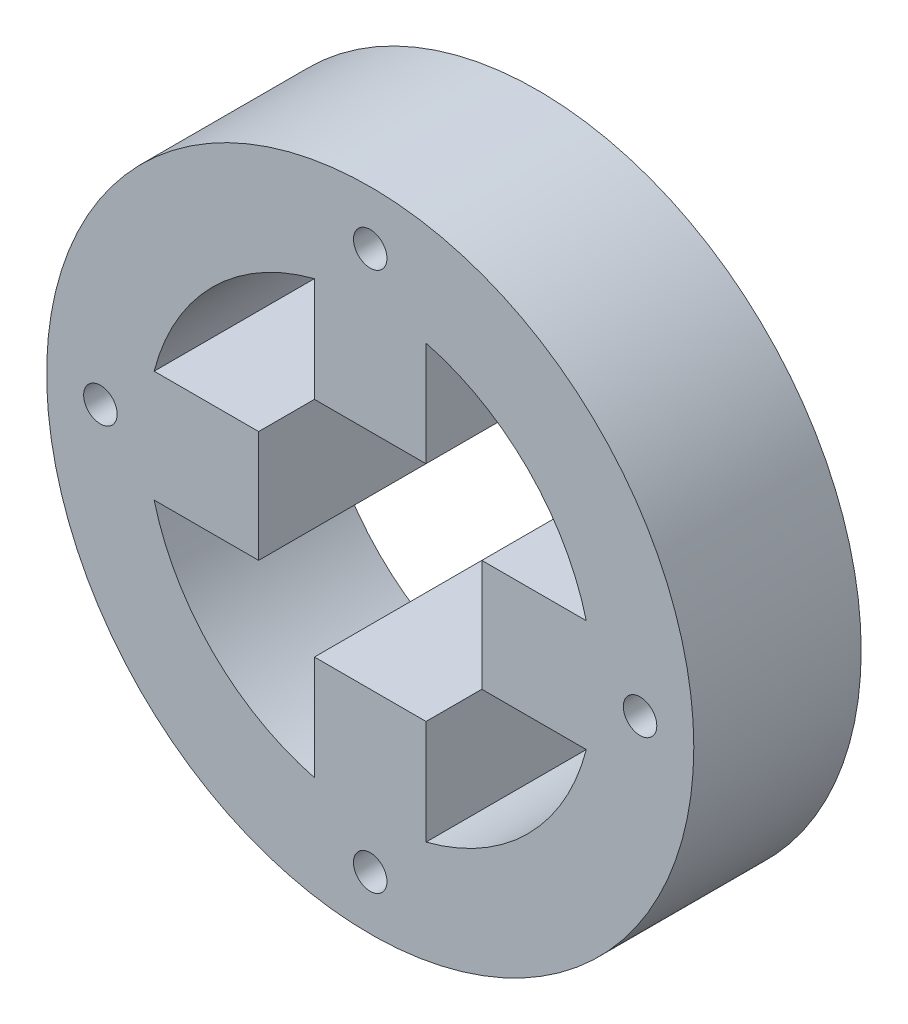
ISO-10303-21;
HEADER;
FILE_DESCRIPTION(('STEP AP214'),'2;1');
FILE_NAME('part.step','',(''),(''),'','','');
FILE_SCHEMA(('AUTOMOTIVE_DESIGN { 1 0 10303 214 1 1 1 1 }'));
ENDSEC;
DATA;
#1=APPLICATION_CONTEXT('core data for automotive mechanical design processes');
#2=APPLICATION_PROTOCOL_DEFINITION('international standard','automotive_design',2000,#1);
#3=PRODUCT_CONTEXT('',#1,'mechanical');
#4=PRODUCT('Part','Part','',(#3));
#5=PRODUCT_RELATED_PRODUCT_CATEGORY('part','',(#4));
#6=PRODUCT_DEFINITION_FORMATION('','',#4);
#7=PRODUCT_DEFINITION_CONTEXT('part definition',#1,'design');
#8=PRODUCT_DEFINITION('design','',#6,#7);
#9=PRODUCT_DEFINITION_SHAPE('','',#8);
#10=(LENGTH_UNIT() NAMED_UNIT(*) SI_UNIT(.MILLI.,.METRE.));
#11=(NAMED_UNIT(*) PLANE_ANGLE_UNIT() SI_UNIT($,.RADIAN.));
#12=(NAMED_UNIT(*) SI_UNIT($,.STERADIAN.) SOLID_ANGLE_UNIT());
#13=UNCERTAINTY_MEASURE_WITH_UNIT(LENGTH_MEASURE(1.E-05),#10,'distance_accuracy_value','');
#14=(GEOMETRIC_REPRESENTATION_CONTEXT(3) GLOBAL_UNCERTAINTY_ASSIGNED_CONTEXT((#13)) GLOBAL_UNIT_ASSIGNED_CONTEXT((#10,
#11,#12)) REPRESENTATION_CONTEXT('',''));
#15=CARTESIAN_POINT('',(0.,0.,0.));
#16=DIRECTION('',(0.,0.,1.));
#17=DIRECTION('',(1.,0.,0.));
#18=AXIS2_PLACEMENT_3D('',#15,#16,#17);
#19=CARTESIAN_POINT('',(0.,0.,-15.));
#20=DIRECTION('',(0.,0.,1.));
#21=DIRECTION('',(1.,0.,0.));
#22=AXIS2_PLACEMENT_3D('',#19,#20,#21);
#23=CYLINDRICAL_SURFACE('',#22,20.);
#24=DIRECTION('',(0.,0.,1.));
#25=VECTOR('',#24,1.);
#26=CARTESIAN_POINT('',(-5.,-19.3649167310371,-15.));
#27=LINE('',#26,#25);
#28=CARTESIAN_POINT('',(-5.,-19.3649167310371,-15.));
#29=VERTEX_POINT('',#28);
#30=CARTESIAN_POINT('',(-5.,-19.3649167310371,0.));
#31=VERTEX_POINT('',#30);
#32=EDGE_CURVE('E67',#29,#31,#27,.T.);
#33=ORIENTED_EDGE('',*,*,#32,.F.);
#34=CARTESIAN_POINT('',(0.,0.,-15.));
#35=DIRECTION('',(0.,0.,1.));
#36=DIRECTION('',(1.,0.,0.));
#37=AXIS2_PLACEMENT_3D('',#34,#35,#36);
#38=CIRCLE('',#37,20.);
#39=CARTESIAN_POINT('',(-19.3649167310371,-5.,-15.));
#40=VERTEX_POINT('',#39);
#41=EDGE_CURVE('E413',#40,#29,#38,.T.);
#42=ORIENTED_EDGE('',*,*,#41,.F.);
#43=DIRECTION('',(0.,0.,1.));
#44=VECTOR('',#43,1.);
#45=CARTESIAN_POINT('',(-19.3649167310371,-5.,-15.));
#46=LINE('',#45,#44);
#47=CARTESIAN_POINT('',(-19.3649167310371,-5.,0.));
#48=VERTEX_POINT('',#47);
#49=EDGE_CURVE('E218',#40,#48,#46,.T.);
#50=ORIENTED_EDGE('',*,*,#49,.T.);
#51=CARTESIAN_POINT('',(0.,0.,0.));
#52=DIRECTION('',(0.,0.,1.));
#53=DIRECTION('',(1.,0.,0.));
#54=AXIS2_PLACEMENT_3D('',#51,#52,#53);
#55=CIRCLE('',#54,20.);
#56=EDGE_CURVE('E432',#48,#31,#55,.T.);
#57=ORIENTED_EDGE('',*,*,#56,.T.);
#58=EDGE_LOOP('',(#33,#42,#50,#57));
#59=FACE_BOUND('',#58,.T.);
#60=ADVANCED_FACE('F41',(#59),#23,.F.);
#61=DIRECTION('',(0.,0.,1.));
#62=VECTOR('',#61,1.);
#63=CARTESIAN_POINT('',(-19.3649167310371,5.,-15.));
#64=LINE('',#63,#62);
#65=CARTESIAN_POINT('',(-19.3649167310371,5.,-15.));
#66=VERTEX_POINT('',#65);
#67=CARTESIAN_POINT('',(-19.3649167310371,5.,0.));
#68=VERTEX_POINT('',#67);
#69=EDGE_CURVE('E228',#66,#68,#64,.T.);
#70=ORIENTED_EDGE('',*,*,#69,.F.);
#71=CARTESIAN_POINT('',(-5.,19.3649167310371,-15.));
#72=VERTEX_POINT('',#71);
#73=EDGE_CURVE('E320',#72,#66,#38,.T.);
#74=ORIENTED_EDGE('',*,*,#73,.F.);
#75=DIRECTION('',(0.,0.,1.));
#76=VECTOR('',#75,1.);
#77=CARTESIAN_POINT('',(-5.,19.3649167310371,-15.));
#78=LINE('',#77,#76);
#79=CARTESIAN_POINT('',(-5.,19.3649167310371,0.));
#80=VERTEX_POINT('',#79);
#81=EDGE_CURVE('E273',#72,#80,#78,.T.);
#82=ORIENTED_EDGE('',*,*,#81,.T.);
#83=EDGE_CURVE('E323',#80,#68,#55,.T.);
#84=ORIENTED_EDGE('',*,*,#83,.T.);
#85=EDGE_LOOP('',(#70,#74,#82,#84));
#86=FACE_BOUND('',#85,.T.);
#87=ADVANCED_FACE('F373',(#86),#23,.F.);
#88=DIRECTION('',(0.,0.,1.));
#89=VECTOR('',#88,1.);
#90=CARTESIAN_POINT('',(5.,19.3649167310371,-15.));
#91=LINE('',#90,#89);
#92=CARTESIAN_POINT('',(5.,19.3649167310371,-15.));
#93=VERTEX_POINT('',#92);
#94=CARTESIAN_POINT('',(5.,19.3649167310371,0.));
#95=VERTEX_POINT('',#94);
#96=EDGE_CURVE('E255',#93,#95,#91,.T.);
#97=ORIENTED_EDGE('',*,*,#96,.F.);
#98=CARTESIAN_POINT('',(19.3649167310371,5.,-15.));
#99=VERTEX_POINT('',#98);
#100=EDGE_CURVE('E317',#99,#93,#38,.T.);
#101=ORIENTED_EDGE('',*,*,#100,.F.);
#102=DIRECTION('',(0.,0.,1.));
#103=VECTOR('',#102,1.);
#104=CARTESIAN_POINT('',(19.3649167310371,5.,-15.));
#105=LINE('',#104,#103);
#106=CARTESIAN_POINT('',(19.3649167310371,5.,0.));
#107=VERTEX_POINT('',#106);
#108=EDGE_CURVE('E310',#99,#107,#105,.T.);
#109=ORIENTED_EDGE('',*,*,#108,.T.);
#110=EDGE_CURVE('E321',#107,#95,#55,.T.);
#111=ORIENTED_EDGE('',*,*,#110,.T.);
#112=EDGE_LOOP('',(#97,#101,#109,#111));
#113=FACE_BOUND('',#112,.T.);
#114=ADVANCED_FACE('F379',(#113),#23,.F.);
#115=CARTESIAN_POINT('',(5.,-19.3649167310371,-15.));
#116=VERTEX_POINT('',#115);
#117=CARTESIAN_POINT('',(19.3649167310371,-5.,-15.));
#118=VERTEX_POINT('',#117);
#119=EDGE_CURVE('E59',#116,#118,#38,.T.);
#120=ORIENTED_EDGE('',*,*,#119,.F.);
#121=DIRECTION('',(0.,0.,1.));
#122=VECTOR('',#121,1.);
#123=CARTESIAN_POINT('',(5.,-19.3649167310371,-15.));
#124=LINE('',#123,#122);
#125=CARTESIAN_POINT('',(5.,-19.3649167310371,0.));
#126=VERTEX_POINT('',#125);
#127=EDGE_CURVE('E181',#116,#126,#124,.T.);
#128=ORIENTED_EDGE('',*,*,#127,.T.);
#129=CARTESIAN_POINT('',(19.3649167310371,-5.,0.));
#130=VERTEX_POINT('',#129);
#131=EDGE_CURVE('E306',#126,#130,#55,.T.);
#132=ORIENTED_EDGE('',*,*,#131,.T.);
#133=DIRECTION('',(0.,0.,1.));
#134=VECTOR('',#133,1.);
#135=CARTESIAN_POINT('',(19.3649167310371,-5.,-15.));
#136=LINE('',#135,#134);
#137=EDGE_CURVE('E292',#118,#130,#136,.T.);
#138=ORIENTED_EDGE('',*,*,#137,.F.);
#139=EDGE_LOOP('',(#120,#128,#132,#138));
#140=FACE_BOUND('',#139,.T.);
#141=ADVANCED_FACE('F375',(#140),#23,.F.);
#142=CARTESIAN_POINT('',(0.,0.,-15.));
#143=DIRECTION('',(0.,0.,1.));
#144=DIRECTION('',(1.,0.,0.));
#145=AXIS2_PLACEMENT_3D('',#142,#143,#144);
#146=CYLINDRICAL_SURFACE('',#145,29.);
#147=CARTESIAN_POINT('',(0.,0.,-15.));
#148=DIRECTION('',(0.,0.,1.));
#149=DIRECTION('',(1.,0.,0.));
#150=AXIS2_PLACEMENT_3D('',#147,#148,#149);
#151=CIRCLE('',#150,29.);
#152=CARTESIAN_POINT('',(29.,0.,-15.));
#153=VERTEX_POINT('',#152);
#154=EDGE_CURVE('E11',#153,#153,#151,.T.);
#155=ORIENTED_EDGE('',*,*,#154,.T.);
#156=EDGE_LOOP('',(#155));
#157=FACE_BOUND('',#156,.T.);
#158=CARTESIAN_POINT('',(0.,0.,0.));
#159=DIRECTION('',(0.,0.,1.));
#160=DIRECTION('',(1.,0.,0.));
#161=AXIS2_PLACEMENT_3D('',#158,#159,#160);
#162=CIRCLE('',#161,29.);
#163=CARTESIAN_POINT('',(29.,0.,0.));
#164=VERTEX_POINT('',#163);
#165=EDGE_CURVE('E51',#164,#164,#162,.T.);
#166=ORIENTED_EDGE('',*,*,#165,.F.);
#167=EDGE_LOOP('',(#166));
#168=FACE_BOUND('',#167,.T.);
#169=ADVANCED_FACE('F43',(#157,#168),#146,.T.);
#170=CARTESIAN_POINT('',(0.,0.,-15.));
#171=DIRECTION('',(0.,0.,1.));
#172=DIRECTION('',(1.,0.,0.));
#173=AXIS2_PLACEMENT_3D('',#170,#171,#172);
#174=PLANE('',#173);
#175=CARTESIAN_POINT('',(0.,24.1824583655185,-15.));
#176=DIRECTION('',(0.,0.,1.));
#177=DIRECTION('',(1.,0.,0.));
#178=AXIS2_PLACEMENT_3D('',#175,#176,#177);
#179=CIRCLE('',#178,1.5);
#180=CARTESIAN_POINT('',(1.5,24.1824583655185,-15.));
#181=VERTEX_POINT('',#180);
#182=EDGE_CURVE('E195',#181,#181,#179,.F.);
#183=ORIENTED_EDGE('',*,*,#182,.F.);
#184=EDGE_LOOP('',(#183));
#185=FACE_BOUND('',#184,.T.);
#186=CARTESIAN_POINT('',(24.1824583655185,0.,-15.));
#187=DIRECTION('',(0.,0.,1.));
#188=DIRECTION('',(1.,0.,0.));
#189=AXIS2_PLACEMENT_3D('',#186,#187,#188);
#190=CIRCLE('',#189,1.5);
#191=CARTESIAN_POINT('',(25.6824583655185,0.,-15.));
#192=VERTEX_POINT('',#191);
#193=EDGE_CURVE('E340',#192,#192,#190,.F.);
#194=ORIENTED_EDGE('',*,*,#193,.F.);
#195=EDGE_LOOP('',(#194));
#196=FACE_BOUND('',#195,.T.);
#197=CARTESIAN_POINT('',(0.,-24.1824583655185,-15.));
#198=DIRECTION('',(0.,0.,1.));
#199=DIRECTION('',(1.,0.,0.));
#200=AXIS2_PLACEMENT_3D('',#197,#198,#199);
#201=CIRCLE('',#200,1.5);
#202=CARTESIAN_POINT('',(1.5,-24.1824583655185,-15.));
#203=VERTEX_POINT('',#202);
#204=EDGE_CURVE('E336',#203,#203,#201,.F.);
#205=ORIENTED_EDGE('',*,*,#204,.F.);
#206=EDGE_LOOP('',(#205));
#207=FACE_BOUND('',#206,.T.);
#208=CARTESIAN_POINT('',(-24.1824583655185,0.,-15.));
#209=DIRECTION('',(0.,0.,1.));
#210=DIRECTION('',(1.,0.,0.));
#211=AXIS2_PLACEMENT_3D('',#208,#209,#210);
#212=CIRCLE('',#211,1.5);
#213=CARTESIAN_POINT('',(-22.6824583655185,0.,-15.));
#214=VERTEX_POINT('',#213);
#215=EDGE_CURVE('E332',#214,#214,#212,.F.);
#216=ORIENTED_EDGE('',*,*,#215,.F.);
#217=EDGE_LOOP('',(#216));
#218=FACE_BOUND('',#217,.T.);
#219=ORIENTED_EDGE('',*,*,#100,.T.);
#220=DIRECTION('',(0.,-1.,0.));
#221=VECTOR('',#220,1.);
#222=CARTESIAN_POINT('',(4.99999999999994,0.,-15.));
#223=LINE('',#222,#221);
#224=CARTESIAN_POINT('',(4.99999999999997,9.99999673103708,-15.));
#225=VERTEX_POINT('',#224);
#226=EDGE_CURVE('E243',#93,#225,#223,.T.);
#227=ORIENTED_EDGE('',*,*,#226,.T.);
#228=DIRECTION('',(1.,0.,0.));
#229=VECTOR('',#228,1.);
#230=CARTESIAN_POINT('',(0.,9.99999673103708,-15.));
#231=LINE('',#230,#229);
#232=CARTESIAN_POINT('',(-5.,9.99999673103708,-15.));
#233=VERTEX_POINT('',#232);
#234=EDGE_CURVE('E251',#233,#225,#231,.T.);
#235=ORIENTED_EDGE('',*,*,#234,.F.);
#236=DIRECTION('',(0.,-1.,0.));
#237=VECTOR('',#236,1.);
#238=CARTESIAN_POINT('',(-5.,0.,-15.));
#239=LINE('',#238,#237);
#240=EDGE_CURVE('E246',#72,#233,#239,.T.);
#241=ORIENTED_EDGE('',*,*,#240,.F.);
#242=ORIENTED_EDGE('',*,*,#73,.T.);
#243=DIRECTION('',(1.,0.,0.));
#244=VECTOR('',#243,1.);
#245=CARTESIAN_POINT('',(0.,5.00000000000001,-15.));
#246=LINE('',#245,#244);
#247=CARTESIAN_POINT('',(-9.99999673103708,5.,-15.));
#248=VERTEX_POINT('',#247);
#249=EDGE_CURVE('E215',#66,#248,#246,.T.);
#250=ORIENTED_EDGE('',*,*,#249,.T.);
#251=DIRECTION('',(0.,-1.,0.));
#252=VECTOR('',#251,1.);
#253=CARTESIAN_POINT('',(-9.99999673103708,0.,-15.));
#254=LINE('',#253,#252);
#255=CARTESIAN_POINT('',(-9.99999673103708,-5.,-15.));
#256=VERTEX_POINT('',#255);
#257=EDGE_CURVE('E211',#248,#256,#254,.T.);
#258=ORIENTED_EDGE('',*,*,#257,.T.);
#259=DIRECTION('',(1.,0.,0.));
#260=VECTOR('',#259,1.);
#261=CARTESIAN_POINT('',(0.,-5.,-15.));
#262=LINE('',#261,#260);
#263=EDGE_CURVE('E207',#40,#256,#262,.T.);
#264=ORIENTED_EDGE('',*,*,#263,.F.);
#265=ORIENTED_EDGE('',*,*,#41,.T.);
#266=DIRECTION('',(0.,1.,0.));
#267=VECTOR('',#266,1.);
#268=CARTESIAN_POINT('',(-5.,0.,-15.));
#269=LINE('',#268,#267);
#270=CARTESIAN_POINT('',(-5.,-9.99999673103708,-15.));
#271=VERTEX_POINT('',#270);
#272=EDGE_CURVE('E166',#29,#271,#269,.T.);
#273=ORIENTED_EDGE('',*,*,#272,.T.);
#274=DIRECTION('',(1.,0.,0.));
#275=VECTOR('',#274,1.);
#276=CARTESIAN_POINT('',(0.,-9.99999673103708,-15.));
#277=LINE('',#276,#275);
#278=CARTESIAN_POINT('',(5.,-9.99999673103708,-15.));
#279=VERTEX_POINT('',#278);
#280=EDGE_CURVE('E158',#271,#279,#277,.T.);
#281=ORIENTED_EDGE('',*,*,#280,.T.);
#282=DIRECTION('',(0.,1.,0.));
#283=VECTOR('',#282,1.);
#284=CARTESIAN_POINT('',(4.99999999999999,0.,-15.));
#285=LINE('',#284,#283);
#286=EDGE_CURVE('E164',#116,#279,#285,.T.);
#287=ORIENTED_EDGE('',*,*,#286,.F.);
#288=ORIENTED_EDGE('',*,*,#119,.T.);
#289=DIRECTION('',(-1.,0.,0.));
#290=VECTOR('',#289,1.);
#291=CARTESIAN_POINT('',(0.,-5.00000000000002,-15.));
#292=LINE('',#291,#290);
#293=CARTESIAN_POINT('',(9.99999673103709,-5.00000000000001,-15.));
#294=VERTEX_POINT('',#293);
#295=EDGE_CURVE('E280',#118,#294,#292,.T.);
#296=ORIENTED_EDGE('',*,*,#295,.T.);
#297=DIRECTION('',(0.,-1.,0.));
#298=VECTOR('',#297,1.);
#299=CARTESIAN_POINT('',(9.99999673103709,0.,-15.));
#300=LINE('',#299,#298);
#301=CARTESIAN_POINT('',(9.99999673103709,5.00000000000001,-15.));
#302=VERTEX_POINT('',#301);
#303=EDGE_CURVE('E288',#302,#294,#300,.T.);
#304=ORIENTED_EDGE('',*,*,#303,.F.);
#305=DIRECTION('',(-1.,0.,0.));
#306=VECTOR('',#305,1.);
#307=CARTESIAN_POINT('',(0.,5.00000000000002,-15.));
#308=LINE('',#307,#306);
#309=EDGE_CURVE('E283',#99,#302,#308,.T.);
#310=ORIENTED_EDGE('',*,*,#309,.F.);
#311=EDGE_LOOP('',(#219,#227,#235,#241,#242,#250,#258,#264,#265,#273,#281,#287,#288,#296,#304,#310));
#312=FACE_BOUND('',#311,.T.);
#313=ORIENTED_EDGE('',*,*,#154,.F.);
#314=EDGE_LOOP('',(#313));
#315=FACE_BOUND('',#314,.T.);
#316=ADVANCED_FACE('F161',(#185,#196,#207,#218,#312,#315),#174,.F.);
#317=CARTESIAN_POINT('',(0.,0.,0.));
#318=DIRECTION('',(0.,0.,1.));
#319=DIRECTION('',(1.,0.,0.));
#320=AXIS2_PLACEMENT_3D('',#317,#318,#319);
#321=PLANE('',#320);
#322=CARTESIAN_POINT('',(0.,24.1824583655185,0.));
#323=DIRECTION('',(0.,0.,1.));
#324=DIRECTION('',(1.,0.,0.));
#325=AXIS2_PLACEMENT_3D('',#322,#323,#324);
#326=CIRCLE('',#325,1.5);
#327=CARTESIAN_POINT('',(1.5,24.1824583655185,0.));
#328=VERTEX_POINT('',#327);
#329=EDGE_CURVE('E45',#328,#328,#326,.F.);
#330=ORIENTED_EDGE('',*,*,#329,.T.);
#331=EDGE_LOOP('',(#330));
#332=FACE_BOUND('',#331,.T.);
#333=CARTESIAN_POINT('',(24.1824583655185,0.,0.));
#334=DIRECTION('',(0.,0.,1.));
#335=DIRECTION('',(1.,0.,0.));
#336=AXIS2_PLACEMENT_3D('',#333,#334,#335);
#337=CIRCLE('',#336,1.5);
#338=CARTESIAN_POINT('',(25.6824583655185,0.,0.));
#339=VERTEX_POINT('',#338);
#340=EDGE_CURVE('E337',#339,#339,#337,.F.);
#341=ORIENTED_EDGE('',*,*,#340,.T.);
#342=EDGE_LOOP('',(#341));
#343=FACE_BOUND('',#342,.T.);
#344=CARTESIAN_POINT('',(0.,-24.1824583655185,0.));
#345=DIRECTION('',(0.,0.,1.));
#346=DIRECTION('',(1.,0.,0.));
#347=AXIS2_PLACEMENT_3D('',#344,#345,#346);
#348=CIRCLE('',#347,1.5);
#349=CARTESIAN_POINT('',(1.5,-24.1824583655185,0.));
#350=VERTEX_POINT('',#349);
#351=EDGE_CURVE('E333',#350,#350,#348,.F.);
#352=ORIENTED_EDGE('',*,*,#351,.T.);
#353=EDGE_LOOP('',(#352));
#354=FACE_BOUND('',#353,.T.);
#355=CARTESIAN_POINT('',(-24.1824583655185,0.,0.));
#356=DIRECTION('',(0.,0.,1.));
#357=DIRECTION('',(1.,0.,0.));
#358=AXIS2_PLACEMENT_3D('',#355,#356,#357);
#359=CIRCLE('',#358,1.5);
#360=CARTESIAN_POINT('',(-22.6824583655185,0.,0.));
#361=VERTEX_POINT('',#360);
#362=EDGE_CURVE('E328',#361,#361,#359,.F.);
#363=ORIENTED_EDGE('',*,*,#362,.T.);
#364=EDGE_LOOP('',(#363));
#365=FACE_BOUND('',#364,.T.);
#366=ORIENTED_EDGE('',*,*,#110,.F.);
#367=DIRECTION('',(-1.,0.,0.));
#368=VECTOR('',#367,1.);
#369=CARTESIAN_POINT('',(0.,5.00000000000002,0.));
#370=LINE('',#369,#368);
#371=CARTESIAN_POINT('',(9.99999673103709,5.00000000000001,0.));
#372=VERTEX_POINT('',#371);
#373=EDGE_CURVE('E296',#107,#372,#370,.T.);
#374=ORIENTED_EDGE('',*,*,#373,.T.);
#375=DIRECTION('',(0.,-1.,0.));
#376=VECTOR('',#375,1.);
#377=CARTESIAN_POINT('',(9.99999673103709,0.,0.));
#378=LINE('',#377,#376);
#379=CARTESIAN_POINT('',(9.99999673103709,-5.00000000000001,0.));
#380=VERTEX_POINT('',#379);
#381=EDGE_CURVE('E284',#372,#380,#378,.T.);
#382=ORIENTED_EDGE('',*,*,#381,.T.);
#383=DIRECTION('',(-1.,0.,0.));
#384=VECTOR('',#383,1.);
#385=CARTESIAN_POINT('',(0.,-5.00000000000002,0.));
#386=LINE('',#385,#384);
#387=EDGE_CURVE('E269',#130,#380,#386,.T.);
#388=ORIENTED_EDGE('',*,*,#387,.F.);
#389=ORIENTED_EDGE('',*,*,#131,.F.);
#390=DIRECTION('',(0.,1.,0.));
#391=VECTOR('',#390,1.);
#392=CARTESIAN_POINT('',(4.99999999999999,0.,0.));
#393=LINE('',#392,#391);
#394=CARTESIAN_POINT('',(5.,-9.99999673103708,0.));
#395=VERTEX_POINT('',#394);
#396=EDGE_CURVE('E194',#126,#395,#393,.T.);
#397=ORIENTED_EDGE('',*,*,#396,.T.);
#398=DIRECTION('',(1.,0.,0.));
#399=VECTOR('',#398,1.);
#400=CARTESIAN_POINT('',(0.,-9.99999673103708,0.));
#401=LINE('',#400,#399);
#402=CARTESIAN_POINT('',(-5.,-9.99999673103708,0.));
#403=VERTEX_POINT('',#402);
#404=EDGE_CURVE('E175',#403,#395,#401,.T.);
#405=ORIENTED_EDGE('',*,*,#404,.F.);
#406=DIRECTION('',(0.,1.,0.));
#407=VECTOR('',#406,1.);
#408=CARTESIAN_POINT('',(-5.,0.,0.));
#409=LINE('',#408,#407);
#410=EDGE_CURVE('E190',#31,#403,#409,.T.);
#411=ORIENTED_EDGE('',*,*,#410,.F.);
#412=ORIENTED_EDGE('',*,*,#56,.F.);
#413=DIRECTION('',(1.,0.,0.));
#414=VECTOR('',#413,1.);
#415=CARTESIAN_POINT('',(0.,-5.,0.));
#416=LINE('',#415,#414);
#417=CARTESIAN_POINT('',(-9.99999673103708,-5.,0.));
#418=VERTEX_POINT('',#417);
#419=EDGE_CURVE('E201',#48,#418,#416,.T.);
#420=ORIENTED_EDGE('',*,*,#419,.T.);
#421=DIRECTION('',(0.,-1.,0.));
#422=VECTOR('',#421,1.);
#423=CARTESIAN_POINT('',(-9.99999673103708,0.,0.));
#424=LINE('',#423,#422);
#425=CARTESIAN_POINT('',(-9.99999673103708,5.,0.));
#426=VERTEX_POINT('',#425);
#427=EDGE_CURVE('E222',#426,#418,#424,.T.);
#428=ORIENTED_EDGE('',*,*,#427,.F.);
#429=DIRECTION('',(1.,0.,0.));
#430=VECTOR('',#429,1.);
#431=CARTESIAN_POINT('',(0.,5.00000000000001,0.));
#432=LINE('',#431,#430);
#433=EDGE_CURVE('E212',#68,#426,#432,.T.);
#434=ORIENTED_EDGE('',*,*,#433,.F.);
#435=ORIENTED_EDGE('',*,*,#83,.F.);
#436=DIRECTION('',(0.,-1.,0.));
#437=VECTOR('',#436,1.);
#438=CARTESIAN_POINT('',(-5.,0.,0.));
#439=LINE('',#438,#437);
#440=CARTESIAN_POINT('',(-5.,9.99999673103708,0.));
#441=VERTEX_POINT('',#440);
#442=EDGE_CURVE('E259',#80,#441,#439,.T.);
#443=ORIENTED_EDGE('',*,*,#442,.T.);
#444=DIRECTION('',(1.,0.,0.));
#445=VECTOR('',#444,1.);
#446=CARTESIAN_POINT('',(0.,9.99999673103708,0.));
#447=LINE('',#446,#445);
#448=CARTESIAN_POINT('',(4.99999999999997,9.99999673103708,0.));
#449=VERTEX_POINT('',#448);
#450=EDGE_CURVE('E247',#441,#449,#447,.T.);
#451=ORIENTED_EDGE('',*,*,#450,.T.);
#452=DIRECTION('',(0.,-1.,0.));
#453=VECTOR('',#452,1.);
#454=CARTESIAN_POINT('',(4.99999999999994,0.,0.));
#455=LINE('',#454,#453);
#456=EDGE_CURVE('E232',#95,#449,#455,.T.);
#457=ORIENTED_EDGE('',*,*,#456,.F.);
#458=EDGE_LOOP('',(#366,#374,#382,#388,#389,#397,#405,#411,#412,#420,#428,#434,#435,#443,#451,#457));
#459=FACE_BOUND('',#458,.T.);
#460=ORIENTED_EDGE('',*,*,#165,.T.);
#461=EDGE_LOOP('',(#460));
#462=FACE_BOUND('',#461,.T.);
#463=ADVANCED_FACE('F360',(#332,#343,#354,#365,#459,#462),#321,.T.);
#464=CARTESIAN_POINT('',(0.,-5.00000000000002,-15.));
#465=DIRECTION('',(0.,1.,0.));
#466=DIRECTION('',(-1.,0.,0.));
#467=AXIS2_PLACEMENT_3D('',#464,#465,#466);
#468=PLANE('',#467);
#469=ORIENTED_EDGE('',*,*,#387,.T.);
#470=DIRECTION('',(0.,0.,1.));
#471=VECTOR('',#470,1.);
#472=CARTESIAN_POINT('',(9.99999673103709,-5.00000000000001,-15.));
#473=LINE('',#472,#471);
#474=EDGE_CURVE('E303',#294,#380,#473,.T.);
#475=ORIENTED_EDGE('',*,*,#474,.F.);
#476=ORIENTED_EDGE('',*,*,#295,.F.);
#477=ORIENTED_EDGE('',*,*,#137,.T.);
#478=EDGE_LOOP('',(#469,#475,#476,#477));
#479=FACE_BOUND('',#478,.T.);
#480=ADVANCED_FACE('F421',(#479),#468,.F.);
#481=CARTESIAN_POINT('',(9.99999673103709,0.,-15.));
#482=DIRECTION('',(-1.,0.,0.));
#483=DIRECTION('',(0.,-1.,0.));
#484=AXIS2_PLACEMENT_3D('',#481,#482,#483);
#485=PLANE('',#484);
#486=ORIENTED_EDGE('',*,*,#381,.F.);
#487=DIRECTION('',(0.,0.,1.));
#488=VECTOR('',#487,1.);
#489=CARTESIAN_POINT('',(9.99999673103709,5.00000000000001,-15.));
#490=LINE('',#489,#488);
#491=EDGE_CURVE('E307',#302,#372,#490,.T.);
#492=ORIENTED_EDGE('',*,*,#491,.F.);
#493=ORIENTED_EDGE('',*,*,#303,.T.);
#494=ORIENTED_EDGE('',*,*,#474,.T.);
#495=EDGE_LOOP('',(#486,#492,#493,#494));
#496=FACE_BOUND('',#495,.T.);
#497=ADVANCED_FACE('F424',(#496),#485,.T.);
#498=CARTESIAN_POINT('',(0.,5.00000000000002,-15.));
#499=DIRECTION('',(0.,1.,0.));
#500=DIRECTION('',(-1.,0.,0.));
#501=AXIS2_PLACEMENT_3D('',#498,#499,#500);
#502=PLANE('',#501);
#503=ORIENTED_EDGE('',*,*,#373,.F.);
#504=ORIENTED_EDGE('',*,*,#108,.F.);
#505=ORIENTED_EDGE('',*,*,#309,.T.);
#506=ORIENTED_EDGE('',*,*,#491,.T.);
#507=EDGE_LOOP('',(#503,#504,#505,#506));
#508=FACE_BOUND('',#507,.T.);
#509=ADVANCED_FACE('F427',(#508),#502,.T.);
#510=CARTESIAN_POINT('',(4.99999999999994,0.,-15.));
#511=DIRECTION('',(-1.,0.,0.));
#512=DIRECTION('',(0.,-1.,0.));
#513=AXIS2_PLACEMENT_3D('',#510,#511,#512);
#514=PLANE('',#513);
#515=ORIENTED_EDGE('',*,*,#456,.T.);
#516=DIRECTION('',(0.,0.,1.));
#517=VECTOR('',#516,1.);
#518=CARTESIAN_POINT('',(4.99999999999997,9.99999673103708,-15.));
#519=LINE('',#518,#517);
#520=EDGE_CURVE('E266',#225,#449,#519,.T.);
#521=ORIENTED_EDGE('',*,*,#520,.F.);
#522=ORIENTED_EDGE('',*,*,#226,.F.);
#523=ORIENTED_EDGE('',*,*,#96,.T.);
#524=EDGE_LOOP('',(#515,#521,#522,#523));
#525=FACE_BOUND('',#524,.T.);
#526=ADVANCED_FACE('F400',(#525),#514,.F.);
#527=CARTESIAN_POINT('',(0.,9.99999673103708,-15.));
#528=DIRECTION('',(0.,-1.,0.));
#529=DIRECTION('',(0.,0.,-1.));
#530=AXIS2_PLACEMENT_3D('',#527,#528,#529);
#531=PLANE('',#530);
#532=ORIENTED_EDGE('',*,*,#450,.F.);
#533=DIRECTION('',(0.,0.,1.));
#534=VECTOR('',#533,1.);
#535=CARTESIAN_POINT('',(-5.,9.99999673103708,-15.));
#536=LINE('',#535,#534);
#537=EDGE_CURVE('E270',#233,#441,#536,.T.);
#538=ORIENTED_EDGE('',*,*,#537,.F.);
#539=ORIENTED_EDGE('',*,*,#234,.T.);
#540=ORIENTED_EDGE('',*,*,#520,.T.);
#541=EDGE_LOOP('',(#532,#538,#539,#540));
#542=FACE_BOUND('',#541,.T.);
#543=ADVANCED_FACE('F403',(#542),#531,.T.);
#544=CARTESIAN_POINT('',(-5.,0.,-15.));
#545=DIRECTION('',(-1.,0.,0.));
#546=DIRECTION('',(0.,-1.,0.));
#547=AXIS2_PLACEMENT_3D('',#544,#545,#546);
#548=PLANE('',#547);
#549=ORIENTED_EDGE('',*,*,#442,.F.);
#550=ORIENTED_EDGE('',*,*,#81,.F.);
#551=ORIENTED_EDGE('',*,*,#240,.T.);
#552=ORIENTED_EDGE('',*,*,#537,.T.);
#553=EDGE_LOOP('',(#549,#550,#551,#552));
#554=FACE_BOUND('',#553,.T.);
#555=ADVANCED_FACE('F410',(#554),#548,.T.);
#556=CARTESIAN_POINT('',(0.,5.00000000000001,-15.));
#557=DIRECTION('',(0.,-1.,0.));
#558=DIRECTION('',(1.,0.,0.));
#559=AXIS2_PLACEMENT_3D('',#556,#557,#558);
#560=PLANE('',#559);
#561=ORIENTED_EDGE('',*,*,#433,.T.);
#562=DIRECTION('',(0.,0.,1.));
#563=VECTOR('',#562,1.);
#564=CARTESIAN_POINT('',(-9.99999673103708,5.,-15.));
#565=LINE('',#564,#563);
#566=EDGE_CURVE('E233',#248,#426,#565,.T.);
#567=ORIENTED_EDGE('',*,*,#566,.F.);
#568=ORIENTED_EDGE('',*,*,#249,.F.);
#569=ORIENTED_EDGE('',*,*,#69,.T.);
#570=EDGE_LOOP('',(#561,#567,#568,#569));
#571=FACE_BOUND('',#570,.T.);
#572=ADVANCED_FACE('F453',(#571),#560,.F.);
#573=CARTESIAN_POINT('',(-9.99999673103708,0.,-15.));
#574=DIRECTION('',(-1.,0.,0.));
#575=DIRECTION('',(0.,-1.,0.));
#576=AXIS2_PLACEMENT_3D('',#573,#574,#575);
#577=PLANE('',#576);
#578=ORIENTED_EDGE('',*,*,#427,.T.);
#579=DIRECTION('',(0.,0.,1.));
#580=VECTOR('',#579,1.);
#581=CARTESIAN_POINT('',(-9.99999673103708,-5.,-15.));
#582=LINE('',#581,#580);
#583=EDGE_CURVE('E237',#256,#418,#582,.T.);
#584=ORIENTED_EDGE('',*,*,#583,.F.);
#585=ORIENTED_EDGE('',*,*,#257,.F.);
#586=ORIENTED_EDGE('',*,*,#566,.T.);
#587=EDGE_LOOP('',(#578,#584,#585,#586));
#588=FACE_BOUND('',#587,.T.);
#589=ADVANCED_FACE('F448',(#588),#577,.F.);
#590=CARTESIAN_POINT('',(0.,-5.,-15.));
#591=DIRECTION('',(0.,-1.,0.));
#592=DIRECTION('',(1.,0.,0.));
#593=AXIS2_PLACEMENT_3D('',#590,#591,#592);
#594=PLANE('',#593);
#595=ORIENTED_EDGE('',*,*,#419,.F.);
#596=ORIENTED_EDGE('',*,*,#49,.F.);
#597=ORIENTED_EDGE('',*,*,#263,.T.);
#598=ORIENTED_EDGE('',*,*,#583,.T.);
#599=EDGE_LOOP('',(#595,#596,#597,#598));
#600=FACE_BOUND('',#599,.T.);
#601=ADVANCED_FACE('F441',(#600),#594,.T.);
#602=CARTESIAN_POINT('',(-5.,0.,-15.));
#603=DIRECTION('',(1.,0.,0.));
#604=DIRECTION('',(0.,1.,0.));
#605=AXIS2_PLACEMENT_3D('',#602,#603,#604);
#606=PLANE('',#605);
#607=ORIENTED_EDGE('',*,*,#410,.T.);
#608=DIRECTION('',(0.,0.,1.));
#609=VECTOR('',#608,1.);
#610=CARTESIAN_POINT('',(-5.,-9.99999673103708,-15.));
#611=LINE('',#610,#609);
#612=EDGE_CURVE('E180',#271,#403,#611,.T.);
#613=ORIENTED_EDGE('',*,*,#612,.F.);
#614=ORIENTED_EDGE('',*,*,#272,.F.);
#615=ORIENTED_EDGE('',*,*,#32,.T.);
#616=EDGE_LOOP('',(#607,#613,#614,#615));
#617=FACE_BOUND('',#616,.T.);
#618=ADVANCED_FACE('F439',(#617),#606,.F.);
#619=CARTESIAN_POINT('',(0.,-9.99999673103708,-15.));
#620=DIRECTION('',(0.,-1.,0.));
#621=DIRECTION('',(0.,0.,-1.));
#622=AXIS2_PLACEMENT_3D('',#619,#620,#621);
#623=PLANE('',#622);
#624=ORIENTED_EDGE('',*,*,#404,.T.);
#625=DIRECTION('',(0.,0.,1.));
#626=VECTOR('',#625,1.);
#627=CARTESIAN_POINT('',(5.,-9.99999673103708,-15.));
#628=LINE('',#627,#626);
#629=EDGE_CURVE('E173',#279,#395,#628,.T.);
#630=ORIENTED_EDGE('',*,*,#629,.F.);
#631=ORIENTED_EDGE('',*,*,#280,.F.);
#632=ORIENTED_EDGE('',*,*,#612,.T.);
#633=EDGE_LOOP('',(#624,#630,#631,#632));
#634=FACE_BOUND('',#633,.T.);
#635=ADVANCED_FACE('F174',(#634),#623,.F.);
#636=CARTESIAN_POINT('',(4.99999999999999,0.,-15.));
#637=DIRECTION('',(1.,0.,0.));
#638=DIRECTION('',(0.,1.,0.));
#639=AXIS2_PLACEMENT_3D('',#636,#637,#638);
#640=PLANE('',#639);
#641=ORIENTED_EDGE('',*,*,#396,.F.);
#642=ORIENTED_EDGE('',*,*,#127,.F.);
#643=ORIENTED_EDGE('',*,*,#286,.T.);
#644=ORIENTED_EDGE('',*,*,#629,.T.);
#645=EDGE_LOOP('',(#641,#642,#643,#644));
#646=FACE_BOUND('',#645,.T.);
#647=ADVANCED_FACE('F183',(#646),#640,.T.);
#648=CARTESIAN_POINT('',(-24.1824583655185,0.,38.));
#649=DIRECTION('',(0.,0.,-1.));
#650=DIRECTION('',(-1.,0.,0.));
#651=AXIS2_PLACEMENT_3D('',#648,#649,#650);
#652=CYLINDRICAL_SURFACE('',#651,1.5);
#653=ORIENTED_EDGE('',*,*,#362,.F.);
#654=EDGE_LOOP('',(#653));
#655=FACE_BOUND('',#654,.T.);
#656=ORIENTED_EDGE('',*,*,#215,.T.);
#657=EDGE_LOOP('',(#656));
#658=FACE_BOUND('',#657,.T.);
#659=ADVANCED_FACE('F487',(#655,#658),#652,.F.);
#660=CARTESIAN_POINT('',(0.,-24.1824583655185,38.));
#661=DIRECTION('',(0.,0.,-1.));
#662=DIRECTION('',(-1.,0.,0.));
#663=AXIS2_PLACEMENT_3D('',#660,#661,#662);
#664=CYLINDRICAL_SURFACE('',#663,1.5);
#665=ORIENTED_EDGE('',*,*,#351,.F.);
#666=EDGE_LOOP('',(#665));
#667=FACE_BOUND('',#666,.T.);
#668=ORIENTED_EDGE('',*,*,#204,.T.);
#669=EDGE_LOOP('',(#668));
#670=FACE_BOUND('',#669,.T.);
#671=ADVANCED_FACE('F369',(#667,#670),#664,.F.);
#672=CARTESIAN_POINT('',(24.1824583655185,0.,38.));
#673=DIRECTION('',(0.,0.,-1.));
#674=DIRECTION('',(-1.,0.,0.));
#675=AXIS2_PLACEMENT_3D('',#672,#673,#674);
#676=CYLINDRICAL_SURFACE('',#675,1.5);
#677=ORIENTED_EDGE('',*,*,#340,.F.);
#678=EDGE_LOOP('',(#677));
#679=FACE_BOUND('',#678,.T.);
#680=ORIENTED_EDGE('',*,*,#193,.T.);
#681=EDGE_LOOP('',(#680));
#682=FACE_BOUND('',#681,.T.);
#683=ADVANCED_FACE('F364',(#679,#682),#676,.F.);
#684=CARTESIAN_POINT('',(0.,24.1824583655185,38.));
#685=DIRECTION('',(0.,0.,-1.));
#686=DIRECTION('',(-1.,0.,0.));
#687=AXIS2_PLACEMENT_3D('',#684,#685,#686);
#688=CYLINDRICAL_SURFACE('',#687,1.5);
#689=ORIENTED_EDGE('',*,*,#329,.F.);
#690=EDGE_LOOP('',(#689));
#691=FACE_BOUND('',#690,.T.);
#692=ORIENTED_EDGE('',*,*,#182,.T.);
#693=EDGE_LOOP('',(#692));
#694=FACE_BOUND('',#693,.T.);
#695=ADVANCED_FACE('F362',(#691,#694),#688,.F.);
#696=CLOSED_SHELL('',(#60,#87,#114,#141,#169,#316,#463,#480,#497,#509,#526,#543,#555,#572,#589,
#601,#618,#635,#647,#659,#671,#683,#695));
#697=MANIFOLD_SOLID_BREP('B2',#696);
#698=ADVANCED_BREP_SHAPE_REPRESENTATION('',(#18,#697),#14);
#699=SHAPE_DEFINITION_REPRESENTATION(#9,#698);
ENDSEC;
END-ISO-10303-21;
